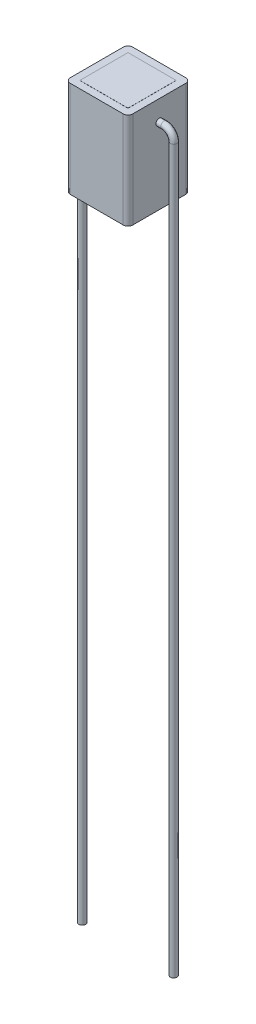
ISO-10303-21;
HEADER;
FILE_DESCRIPTION(('STEP AP214'),'2;1');
FILE_NAME('part.step','',(''),(''),'','','');
FILE_SCHEMA(('AUTOMOTIVE_DESIGN { 1 0 10303 214 1 1 1 1 }'));
ENDSEC;
DATA;
#1=APPLICATION_CONTEXT('core data for automotive mechanical design processes');
#2=APPLICATION_PROTOCOL_DEFINITION('international standard','automotive_design',2000,#1);
#3=PRODUCT_CONTEXT('',#1,'mechanical');
#4=PRODUCT('Part','Part','',(#3));
#5=PRODUCT_RELATED_PRODUCT_CATEGORY('part','',(#4));
#6=PRODUCT_DEFINITION_FORMATION('','',#4);
#7=PRODUCT_DEFINITION_CONTEXT('part definition',#1,'design');
#8=PRODUCT_DEFINITION('design','',#6,#7);
#9=PRODUCT_DEFINITION_SHAPE('','',#8);
#10=(LENGTH_UNIT() NAMED_UNIT(*) SI_UNIT(.MILLI.,.METRE.));
#11=(NAMED_UNIT(*) PLANE_ANGLE_UNIT() SI_UNIT($,.RADIAN.));
#12=(NAMED_UNIT(*) SI_UNIT($,.STERADIAN.) SOLID_ANGLE_UNIT());
#13=UNCERTAINTY_MEASURE_WITH_UNIT(LENGTH_MEASURE(1.E-05),#10,'distance_accuracy_value','');
#14=(GEOMETRIC_REPRESENTATION_CONTEXT(3) GLOBAL_UNCERTAINTY_ASSIGNED_CONTEXT((#13)) GLOBAL_UNIT_ASSIGNED_CONTEXT((#10,
#11,#12)) REPRESENTATION_CONTEXT('',''));
#15=CARTESIAN_POINT('',(0.,0.,0.));
#16=DIRECTION('',(0.,0.,1.));
#17=DIRECTION('',(1.,0.,0.));
#18=AXIS2_PLACEMENT_3D('',#15,#16,#17);
#19=CARTESIAN_POINT('',(3.25000000000001,10.,-3.25));
#20=DIRECTION('',(-1.,0.,0.));
#21=DIRECTION('',(0.,0.,1.));
#22=AXIS2_PLACEMENT_3D('',#19,#20,#21);
#23=PLANE('',#22);
#24=CARTESIAN_POINT('',(3.25000000000001,7.88289673289455,0.));
#25=DIRECTION('',(-1.,0.,0.));
#26=DIRECTION('',(0.,0.,1.));
#27=AXIS2_PLACEMENT_3D('',#24,#25,#26);
#28=CIRCLE('',#27,0.35);
#29=CARTESIAN_POINT('',(3.25000000000001,7.88289673289455,0.35));
#30=VERTEX_POINT('',#29);
#31=EDGE_CURVE('E280',#30,#30,#28,.F.);
#32=ORIENTED_EDGE('',*,*,#31,.F.);
#33=EDGE_LOOP('',(#32));
#34=FACE_BOUND('',#33,.T.);
#35=DIRECTION('',(0.,0.,-1.));
#36=VECTOR('',#35,1.);
#37=CARTESIAN_POINT('',(3.25000000000001,10.,-3.25));
#38=LINE('',#37,#36);
#39=CARTESIAN_POINT('',(3.25000000000001,10.,2.75000000000001));
#40=VERTEX_POINT('',#39);
#41=CARTESIAN_POINT('',(3.25000000000001,10.,-2.75));
#42=VERTEX_POINT('',#41);
#43=EDGE_CURVE('E248',#40,#42,#38,.T.);
#44=ORIENTED_EDGE('',*,*,#43,.F.);
#45=DIRECTION('',(0.,-1.,0.));
#46=VECTOR('',#45,1.);
#47=CARTESIAN_POINT('',(3.25000000000001,10.,2.75000000000001));
#48=LINE('',#47,#46);
#49=CARTESIAN_POINT('',(3.25000000000001,0.,2.75000000000001));
#50=VERTEX_POINT('',#49);
#51=EDGE_CURVE('E288',#40,#50,#48,.T.);
#52=ORIENTED_EDGE('',*,*,#51,.T.);
#53=DIRECTION('',(0.,0.,-1.));
#54=VECTOR('',#53,1.);
#55=CARTESIAN_POINT('',(3.25000000000001,0.,-3.25));
#56=LINE('',#55,#54);
#57=CARTESIAN_POINT('',(3.25000000000001,0.,-2.75));
#58=VERTEX_POINT('',#57);
#59=EDGE_CURVE('E247',#50,#58,#56,.T.);
#60=ORIENTED_EDGE('',*,*,#59,.T.);
#61=DIRECTION('',(0.,-1.,0.));
#62=VECTOR('',#61,1.);
#63=CARTESIAN_POINT('',(3.25000000000001,10.,-2.75));
#64=LINE('',#63,#62);
#65=EDGE_CURVE('E286',#58,#42,#64,.F.);
#66=ORIENTED_EDGE('',*,*,#65,.T.);
#67=EDGE_LOOP('',(#44,#52,#60,#66));
#68=FACE_BOUND('',#67,.T.);
#69=ADVANCED_FACE('F58',(#34,#68),#23,.F.);
#70=CARTESIAN_POINT('',(-3.24999999999999,10.,-3.25));
#71=DIRECTION('',(0.,0.,1.));
#72=DIRECTION('',(1.,0.,0.));
#73=AXIS2_PLACEMENT_3D('',#70,#71,#72);
#74=PLANE('',#73);
#75=DIRECTION('',(-1.,0.,0.));
#76=VECTOR('',#75,1.);
#77=CARTESIAN_POINT('',(-3.24999999999999,0.,-3.25));
#78=LINE('',#77,#76);
#79=CARTESIAN_POINT('',(2.75000000000001,0.,-3.25));
#80=VERTEX_POINT('',#79);
#81=CARTESIAN_POINT('',(-2.74999999999999,0.,-3.25));
#82=VERTEX_POINT('',#81);
#83=EDGE_CURVE('E262',#80,#82,#78,.T.);
#84=ORIENTED_EDGE('',*,*,#83,.T.);
#85=DIRECTION('',(0.,-1.,0.));
#86=VECTOR('',#85,1.);
#87=CARTESIAN_POINT('',(-2.74999999999999,10.,-3.25));
#88=LINE('',#87,#86);
#89=CARTESIAN_POINT('',(-2.74999999999999,10.,-3.25));
#90=VERTEX_POINT('',#89);
#91=EDGE_CURVE('E12',#82,#90,#88,.F.);
#92=ORIENTED_EDGE('',*,*,#91,.T.);
#93=DIRECTION('',(-1.,0.,0.));
#94=VECTOR('',#93,1.);
#95=CARTESIAN_POINT('',(-3.24999999999999,10.,-3.25));
#96=LINE('',#95,#94);
#97=CARTESIAN_POINT('',(2.75000000000001,10.,-3.25));
#98=VERTEX_POINT('',#97);
#99=EDGE_CURVE('E251',#98,#90,#96,.T.);
#100=ORIENTED_EDGE('',*,*,#99,.F.);
#101=DIRECTION('',(0.,-1.,0.));
#102=VECTOR('',#101,1.);
#103=CARTESIAN_POINT('',(2.75000000000001,10.,-3.25));
#104=LINE('',#103,#102);
#105=EDGE_CURVE('E66',#98,#80,#104,.T.);
#106=ORIENTED_EDGE('',*,*,#105,.T.);
#107=EDGE_LOOP('',(#84,#92,#100,#106));
#108=FACE_BOUND('',#107,.T.);
#109=ADVANCED_FACE('F319',(#108),#74,.F.);
#110=CARTESIAN_POINT('',(-3.24999999999999,10.,-3.25));
#111=DIRECTION('',(1.,0.,0.));
#112=DIRECTION('',(0.,0.,-1.));
#113=AXIS2_PLACEMENT_3D('',#110,#111,#112);
#114=PLANE('',#113);
#115=CARTESIAN_POINT('',(-3.24999999999999,7.88289673289455,0.));
#116=DIRECTION('',(1.,0.,0.));
#117=DIRECTION('',(0.,0.,-1.));
#118=AXIS2_PLACEMENT_3D('',#115,#116,#117);
#119=CIRCLE('',#118,0.35);
#120=CARTESIAN_POINT('',(-3.24999999999999,7.88289673289455,-0.35));
#121=VERTEX_POINT('',#120);
#122=EDGE_CURVE('E283',#121,#121,#119,.F.);
#123=ORIENTED_EDGE('',*,*,#122,.F.);
#124=EDGE_LOOP('',(#123));
#125=FACE_BOUND('',#124,.T.);
#126=DIRECTION('',(0.,0.,1.));
#127=VECTOR('',#126,1.);
#128=CARTESIAN_POINT('',(-3.24999999999999,0.,-3.25));
#129=LINE('',#128,#127);
#130=CARTESIAN_POINT('',(-3.24999999999999,0.,-2.75));
#131=VERTEX_POINT('',#130);
#132=CARTESIAN_POINT('',(-3.24999999999999,0.,2.75000000000001));
#133=VERTEX_POINT('',#132);
#134=EDGE_CURVE('E265',#131,#133,#129,.T.);
#135=ORIENTED_EDGE('',*,*,#134,.T.);
#136=DIRECTION('',(0.,-1.,0.));
#137=VECTOR('',#136,1.);
#138=CARTESIAN_POINT('',(-3.24999999999999,10.,2.75000000000001));
#139=LINE('',#138,#137);
#140=CARTESIAN_POINT('',(-3.24999999999999,10.,2.75000000000001));
#141=VERTEX_POINT('',#140);
#142=EDGE_CURVE('E73',#133,#141,#139,.F.);
#143=ORIENTED_EDGE('',*,*,#142,.T.);
#144=DIRECTION('',(0.,0.,1.));
#145=VECTOR('',#144,1.);
#146=CARTESIAN_POINT('',(-3.24999999999999,10.,-3.25));
#147=LINE('',#146,#145);
#148=CARTESIAN_POINT('',(-3.24999999999999,10.,-2.75));
#149=VERTEX_POINT('',#148);
#150=EDGE_CURVE('E254',#149,#141,#147,.T.);
#151=ORIENTED_EDGE('',*,*,#150,.F.);
#152=DIRECTION('',(0.,-1.,0.));
#153=VECTOR('',#152,1.);
#154=CARTESIAN_POINT('',(-3.24999999999999,10.,-2.75));
#155=LINE('',#154,#153);
#156=EDGE_CURVE('E311',#149,#131,#155,.T.);
#157=ORIENTED_EDGE('',*,*,#156,.T.);
#158=EDGE_LOOP('',(#135,#143,#151,#157));
#159=FACE_BOUND('',#158,.T.);
#160=ADVANCED_FACE('F330',(#125,#159),#114,.F.);
#161=CARTESIAN_POINT('',(-3.24999999999999,10.,3.25000000000001));
#162=DIRECTION('',(0.,0.,-1.));
#163=DIRECTION('',(-1.,0.,0.));
#164=AXIS2_PLACEMENT_3D('',#161,#162,#163);
#165=PLANE('',#164);
#166=DIRECTION('',(1.,0.,0.));
#167=VECTOR('',#166,1.);
#168=CARTESIAN_POINT('',(-3.24999999999999,0.,3.25000000000001));
#169=LINE('',#168,#167);
#170=CARTESIAN_POINT('',(-2.74999999999999,0.,3.25000000000001));
#171=VERTEX_POINT('',#170);
#172=CARTESIAN_POINT('',(2.75000000000001,0.,3.25000000000001));
#173=VERTEX_POINT('',#172);
#174=EDGE_CURVE('E252',#171,#173,#169,.T.);
#175=ORIENTED_EDGE('',*,*,#174,.T.);
#176=DIRECTION('',(0.,-1.,0.));
#177=VECTOR('',#176,1.);
#178=CARTESIAN_POINT('',(2.75000000000001,10.,3.25000000000001));
#179=LINE('',#178,#177);
#180=CARTESIAN_POINT('',(2.75000000000001,10.,3.25000000000001));
#181=VERTEX_POINT('',#180);
#182=EDGE_CURVE('E302',#173,#181,#179,.F.);
#183=ORIENTED_EDGE('',*,*,#182,.T.);
#184=DIRECTION('',(1.,0.,0.));
#185=VECTOR('',#184,1.);
#186=CARTESIAN_POINT('',(-3.24999999999999,10.,3.25000000000001));
#187=LINE('',#186,#185);
#188=CARTESIAN_POINT('',(-2.74999999999999,10.,3.25000000000001));
#189=VERTEX_POINT('',#188);
#190=EDGE_CURVE('E256',#189,#181,#187,.T.);
#191=ORIENTED_EDGE('',*,*,#190,.F.);
#192=DIRECTION('',(0.,-1.,0.));
#193=VECTOR('',#192,1.);
#194=CARTESIAN_POINT('',(-2.74999999999999,10.,3.25000000000001));
#195=LINE('',#194,#193);
#196=EDGE_CURVE('E299',#189,#171,#195,.T.);
#197=ORIENTED_EDGE('',*,*,#196,.T.);
#198=EDGE_LOOP('',(#175,#183,#191,#197));
#199=FACE_BOUND('',#198,.T.);
#200=ADVANCED_FACE('F339',(#199),#165,.F.);
#201=CARTESIAN_POINT('',(0.,10.,0.));
#202=DIRECTION('',(0.,1.,0.));
#203=DIRECTION('',(0.,0.,1.));
#204=AXIS2_PLACEMENT_3D('',#201,#202,#203);
#205=PLANE('',#204);
#206=DIRECTION('',(0.,0.,-1.));
#207=VECTOR('',#206,1.);
#208=CARTESIAN_POINT('',(2.5,10.,0.));
#209=LINE('',#208,#207);
#210=CARTESIAN_POINT('',(2.5,10.,2.5));
#211=VERTEX_POINT('',#210);
#212=CARTESIAN_POINT('',(2.5,10.,-2.5));
#213=VERTEX_POINT('',#212);
#214=EDGE_CURVE('E244',#211,#213,#209,.T.);
#215=ORIENTED_EDGE('',*,*,#214,.F.);
#216=DIRECTION('',(1.,0.,0.));
#217=VECTOR('',#216,1.);
#218=CARTESIAN_POINT('',(0.,10.,2.5));
#219=LINE('',#218,#217);
#220=CARTESIAN_POINT('',(-2.5,10.,2.5));
#221=VERTEX_POINT('',#220);
#222=EDGE_CURVE('E241',#221,#211,#219,.T.);
#223=ORIENTED_EDGE('',*,*,#222,.F.);
#224=DIRECTION('',(0.,0.,1.));
#225=VECTOR('',#224,1.);
#226=CARTESIAN_POINT('',(-2.5,10.,0.));
#227=LINE('',#226,#225);
#228=CARTESIAN_POINT('',(-2.5,10.,-2.5));
#229=VERTEX_POINT('',#228);
#230=EDGE_CURVE('E238',#229,#221,#227,.T.);
#231=ORIENTED_EDGE('',*,*,#230,.F.);
#232=DIRECTION('',(-1.,0.,0.));
#233=VECTOR('',#232,1.);
#234=CARTESIAN_POINT('',(0.,10.,-2.5));
#235=LINE('',#234,#233);
#236=EDGE_CURVE('E224',#213,#229,#235,.T.);
#237=ORIENTED_EDGE('',*,*,#236,.F.);
#238=EDGE_LOOP('',(#215,#223,#231,#237));
#239=FACE_BOUND('',#238,.T.);
#240=ORIENTED_EDGE('',*,*,#190,.T.);
#241=CARTESIAN_POINT('',(2.75000000000001,10.,2.75000000000001));
#242=DIRECTION('',(0.,1.,0.));
#243=DIRECTION('',(0.,0.,1.));
#244=AXIS2_PLACEMENT_3D('',#241,#242,#243);
#245=CIRCLE('',#244,0.5);
#246=EDGE_CURVE('E309',#181,#40,#245,.T.);
#247=ORIENTED_EDGE('',*,*,#246,.T.);
#248=ORIENTED_EDGE('',*,*,#43,.T.);
#249=CARTESIAN_POINT('',(2.75000000000001,10.,-2.75));
#250=DIRECTION('',(0.,1.,0.));
#251=DIRECTION('',(0.,0.,1.));
#252=AXIS2_PLACEMENT_3D('',#249,#250,#251);
#253=CIRCLE('',#252,0.5);
#254=EDGE_CURVE('E304',#42,#98,#253,.T.);
#255=ORIENTED_EDGE('',*,*,#254,.T.);
#256=ORIENTED_EDGE('',*,*,#99,.T.);
#257=CARTESIAN_POINT('',(-2.74999999999999,10.,-2.75));
#258=DIRECTION('',(0.,1.,0.));
#259=DIRECTION('',(0.,0.,1.));
#260=AXIS2_PLACEMENT_3D('',#257,#258,#259);
#261=CIRCLE('',#260,0.5);
#262=EDGE_CURVE('E80',#90,#149,#261,.T.);
#263=ORIENTED_EDGE('',*,*,#262,.T.);
#264=ORIENTED_EDGE('',*,*,#150,.T.);
#265=CARTESIAN_POINT('',(-2.74999999999999,10.,2.75000000000001));
#266=DIRECTION('',(0.,1.,0.));
#267=DIRECTION('',(0.,0.,1.));
#268=AXIS2_PLACEMENT_3D('',#265,#266,#267);
#269=CIRCLE('',#268,0.5);
#270=EDGE_CURVE('E307',#141,#189,#269,.T.);
#271=ORIENTED_EDGE('',*,*,#270,.T.);
#272=EDGE_LOOP('',(#240,#247,#248,#255,#256,#263,#264,#271));
#273=FACE_BOUND('',#272,.T.);
#274=ADVANCED_FACE('F332',(#239,#273),#205,.T.);
#275=CARTESIAN_POINT('',(0.,0.,0.));
#276=DIRECTION('',(0.,1.,0.));
#277=DIRECTION('',(0.,0.,1.));
#278=AXIS2_PLACEMENT_3D('',#275,#276,#277);
#279=PLANE('',#278);
#280=DIRECTION('',(1.,0.,0.));
#281=VECTOR('',#280,1.);
#282=CARTESIAN_POINT('',(0.,0.,2.5));
#283=LINE('',#282,#281);
#284=CARTESIAN_POINT('',(-2.5,0.,2.5));
#285=VERTEX_POINT('',#284);
#286=CARTESIAN_POINT('',(2.5,0.,2.5));
#287=VERTEX_POINT('',#286);
#288=EDGE_CURVE('E274',#285,#287,#283,.T.);
#289=ORIENTED_EDGE('',*,*,#288,.T.);
#290=DIRECTION('',(0.,0.,-1.));
#291=VECTOR('',#290,1.);
#292=CARTESIAN_POINT('',(2.5,0.,0.));
#293=LINE('',#292,#291);
#294=CARTESIAN_POINT('',(2.5,0.,-2.5));
#295=VERTEX_POINT('',#294);
#296=EDGE_CURVE('E277',#287,#295,#293,.T.);
#297=ORIENTED_EDGE('',*,*,#296,.T.);
#298=DIRECTION('',(-1.,0.,0.));
#299=VECTOR('',#298,1.);
#300=CARTESIAN_POINT('',(0.,0.,-2.5));
#301=LINE('',#300,#299);
#302=CARTESIAN_POINT('',(-2.5,0.,-2.5));
#303=VERTEX_POINT('',#302);
#304=EDGE_CURVE('E259',#295,#303,#301,.T.);
#305=ORIENTED_EDGE('',*,*,#304,.T.);
#306=DIRECTION('',(0.,0.,1.));
#307=VECTOR('',#306,1.);
#308=CARTESIAN_POINT('',(-2.5,0.,0.));
#309=LINE('',#308,#307);
#310=EDGE_CURVE('E271',#303,#285,#309,.T.);
#311=ORIENTED_EDGE('',*,*,#310,.T.);
#312=EDGE_LOOP('',(#289,#297,#305,#311));
#313=FACE_BOUND('',#312,.T.);
#314=ORIENTED_EDGE('',*,*,#59,.F.);
#315=CARTESIAN_POINT('',(2.75000000000001,0.,2.75000000000001));
#316=DIRECTION('',(0.,1.,0.));
#317=DIRECTION('',(0.,0.,1.));
#318=AXIS2_PLACEMENT_3D('',#315,#316,#317);
#319=CIRCLE('',#318,0.5);
#320=EDGE_CURVE('E297',#50,#173,#319,.F.);
#321=ORIENTED_EDGE('',*,*,#320,.T.);
#322=ORIENTED_EDGE('',*,*,#174,.F.);
#323=CARTESIAN_POINT('',(-2.74999999999999,0.,2.75000000000001));
#324=DIRECTION('',(0.,1.,0.));
#325=DIRECTION('',(0.,0.,1.));
#326=AXIS2_PLACEMENT_3D('',#323,#324,#325);
#327=CIRCLE('',#326,0.5);
#328=EDGE_CURVE('E295',#171,#133,#327,.F.);
#329=ORIENTED_EDGE('',*,*,#328,.T.);
#330=ORIENTED_EDGE('',*,*,#134,.F.);
#331=CARTESIAN_POINT('',(-2.74999999999999,0.,-2.75));
#332=DIRECTION('',(0.,1.,0.));
#333=DIRECTION('',(0.,0.,1.));
#334=AXIS2_PLACEMENT_3D('',#331,#332,#333);
#335=CIRCLE('',#334,0.5);
#336=EDGE_CURVE('E293',#131,#82,#335,.F.);
#337=ORIENTED_EDGE('',*,*,#336,.T.);
#338=ORIENTED_EDGE('',*,*,#83,.F.);
#339=CARTESIAN_POINT('',(2.75000000000001,0.,-2.75));
#340=DIRECTION('',(0.,1.,0.));
#341=DIRECTION('',(0.,0.,1.));
#342=AXIS2_PLACEMENT_3D('',#339,#340,#341);
#343=CIRCLE('',#342,0.5);
#344=EDGE_CURVE('E291',#80,#58,#343,.F.);
#345=ORIENTED_EDGE('',*,*,#344,.T.);
#346=EDGE_LOOP('',(#314,#321,#322,#329,#330,#337,#338,#345));
#347=FACE_BOUND('',#346,.T.);
#348=ADVANCED_FACE('F325',(#313,#347),#279,.F.);
#349=CARTESIAN_POINT('',(0.,-0.01,0.));
#350=DIRECTION('',(0.,1.,0.));
#351=DIRECTION('',(0.,0.,1.));
#352=AXIS2_PLACEMENT_3D('',#349,#350,#351);
#353=PLANE('',#352);
#354=DIRECTION('',(0.,0.,-1.));
#355=VECTOR('',#354,1.);
#356=CARTESIAN_POINT('',(2.5,-0.01,-2.5));
#357=LINE('',#356,#355);
#358=CARTESIAN_POINT('',(2.5,-0.01,2.5));
#359=VERTEX_POINT('',#358);
#360=CARTESIAN_POINT('',(2.5,-0.01,-2.5));
#361=VERTEX_POINT('',#360);
#362=EDGE_CURVE('E208',#359,#361,#357,.T.);
#363=ORIENTED_EDGE('',*,*,#362,.F.);
#364=DIRECTION('',(1.,0.,0.));
#365=VECTOR('',#364,1.);
#366=CARTESIAN_POINT('',(-2.5,-0.01,2.5));
#367=LINE('',#366,#365);
#368=CARTESIAN_POINT('',(-2.5,-0.01,2.5));
#369=VERTEX_POINT('',#368);
#370=EDGE_CURVE('E217',#369,#359,#367,.T.);
#371=ORIENTED_EDGE('',*,*,#370,.F.);
#372=DIRECTION('',(0.,0.,1.));
#373=VECTOR('',#372,1.);
#374=CARTESIAN_POINT('',(-2.5,-0.01,-2.5));
#375=LINE('',#374,#373);
#376=CARTESIAN_POINT('',(-2.5,-0.01,-2.5));
#377=VERTEX_POINT('',#376);
#378=EDGE_CURVE('E214',#377,#369,#375,.T.);
#379=ORIENTED_EDGE('',*,*,#378,.F.);
#380=DIRECTION('',(-1.,0.,0.));
#381=VECTOR('',#380,1.);
#382=CARTESIAN_POINT('',(-2.5,-0.01,-2.5));
#383=LINE('',#382,#381);
#384=EDGE_CURVE('E211',#361,#377,#383,.T.);
#385=ORIENTED_EDGE('',*,*,#384,.F.);
#386=EDGE_LOOP('',(#363,#371,#379,#385));
#387=FACE_BOUND('',#386,.T.);
#388=ADVANCED_FACE('F540',(#387),#353,.F.);
#389=CARTESIAN_POINT('',(-2.5,-0.01,-2.5));
#390=DIRECTION('',(0.,0.,-1.));
#391=DIRECTION('',(-1.,0.,0.));
#392=AXIS2_PLACEMENT_3D('',#389,#390,#391);
#393=PLANE('',#392);
#394=ORIENTED_EDGE('',*,*,#304,.F.);
#395=DIRECTION('',(0.,1.,0.));
#396=VECTOR('',#395,1.);
#397=CARTESIAN_POINT('',(2.5,-0.01,-2.5));
#398=LINE('',#397,#396);
#399=EDGE_CURVE('E233',#361,#295,#398,.T.);
#400=ORIENTED_EDGE('',*,*,#399,.F.);
#401=ORIENTED_EDGE('',*,*,#384,.T.);
#402=DIRECTION('',(0.,1.,0.));
#403=VECTOR('',#402,1.);
#404=CARTESIAN_POINT('',(-2.5,-0.01,-2.5));
#405=LINE('',#404,#403);
#406=EDGE_CURVE('E230',#377,#303,#405,.T.);
#407=ORIENTED_EDGE('',*,*,#406,.T.);
#408=EDGE_LOOP('',(#394,#400,#401,#407));
#409=FACE_BOUND('',#408,.T.);
#410=ADVANCED_FACE('F483',(#409),#393,.T.);
#411=CARTESIAN_POINT('',(-2.5,-0.01,-2.5));
#412=DIRECTION('',(-1.,0.,0.));
#413=DIRECTION('',(0.,0.,1.));
#414=AXIS2_PLACEMENT_3D('',#411,#412,#413);
#415=PLANE('',#414);
#416=ORIENTED_EDGE('',*,*,#310,.F.);
#417=ORIENTED_EDGE('',*,*,#406,.F.);
#418=ORIENTED_EDGE('',*,*,#378,.T.);
#419=DIRECTION('',(0.,1.,0.));
#420=VECTOR('',#419,1.);
#421=CARTESIAN_POINT('',(-2.5,-0.01,2.5));
#422=LINE('',#421,#420);
#423=EDGE_CURVE('E226',#369,#285,#422,.T.);
#424=ORIENTED_EDGE('',*,*,#423,.T.);
#425=EDGE_LOOP('',(#416,#417,#418,#424));
#426=FACE_BOUND('',#425,.T.);
#427=ADVANCED_FACE('F493',(#426),#415,.T.);
#428=CARTESIAN_POINT('',(-2.5,-0.01,2.5));
#429=DIRECTION('',(0.,0.,1.));
#430=DIRECTION('',(1.,0.,0.));
#431=AXIS2_PLACEMENT_3D('',#428,#429,#430);
#432=PLANE('',#431);
#433=ORIENTED_EDGE('',*,*,#288,.F.);
#434=ORIENTED_EDGE('',*,*,#423,.F.);
#435=ORIENTED_EDGE('',*,*,#370,.T.);
#436=DIRECTION('',(0.,1.,0.));
#437=VECTOR('',#436,1.);
#438=CARTESIAN_POINT('',(2.5,-0.01,2.5));
#439=LINE('',#438,#437);
#440=EDGE_CURVE('E221',#359,#287,#439,.T.);
#441=ORIENTED_EDGE('',*,*,#440,.T.);
#442=EDGE_LOOP('',(#433,#434,#435,#441));
#443=FACE_BOUND('',#442,.T.);
#444=ADVANCED_FACE('F503',(#443),#432,.T.);
#445=CARTESIAN_POINT('',(2.5,-0.01,-2.5));
#446=DIRECTION('',(1.,0.,0.));
#447=DIRECTION('',(0.,0.,-1.));
#448=AXIS2_PLACEMENT_3D('',#445,#446,#447);
#449=PLANE('',#448);
#450=ORIENTED_EDGE('',*,*,#296,.F.);
#451=ORIENTED_EDGE('',*,*,#440,.F.);
#452=ORIENTED_EDGE('',*,*,#362,.T.);
#453=ORIENTED_EDGE('',*,*,#399,.T.);
#454=EDGE_LOOP('',(#450,#451,#452,#453));
#455=FACE_BOUND('',#454,.T.);
#456=ADVANCED_FACE('F510',(#455),#449,.T.);
#457=CARTESIAN_POINT('',(2.5,10.01,2.5));
#458=VERTEX_POINT('',#457);
#459=EDGE_CURVE('E225',#211,#458,#439,.T.);
#460=ORIENTED_EDGE('',*,*,#459,.F.);
#461=ORIENTED_EDGE('',*,*,#214,.T.);
#462=CARTESIAN_POINT('',(2.5,10.01,-2.5));
#463=VERTEX_POINT('',#462);
#464=EDGE_CURVE('E220',#213,#463,#398,.T.);
#465=ORIENTED_EDGE('',*,*,#464,.T.);
#466=DIRECTION('',(0.,0.,-1.));
#467=VECTOR('',#466,1.);
#468=CARTESIAN_POINT('',(2.5,10.01,-2.5));
#469=LINE('',#468,#467);
#470=EDGE_CURVE('E196',#458,#463,#469,.T.);
#471=ORIENTED_EDGE('',*,*,#470,.F.);
#472=EDGE_LOOP('',(#460,#461,#465,#471));
#473=FACE_BOUND('',#472,.T.);
#474=ADVANCED_FACE('F500',(#473),#449,.T.);
#475=CARTESIAN_POINT('',(-2.5,10.01,2.5));
#476=VERTEX_POINT('',#475);
#477=EDGE_CURVE('E229',#221,#476,#422,.T.);
#478=ORIENTED_EDGE('',*,*,#477,.F.);
#479=ORIENTED_EDGE('',*,*,#222,.T.);
#480=ORIENTED_EDGE('',*,*,#459,.T.);
#481=DIRECTION('',(1.,0.,0.));
#482=VECTOR('',#481,1.);
#483=CARTESIAN_POINT('',(-2.5,10.01,2.5));
#484=LINE('',#483,#482);
#485=EDGE_CURVE('E205',#476,#458,#484,.T.);
#486=ORIENTED_EDGE('',*,*,#485,.F.);
#487=EDGE_LOOP('',(#478,#479,#480,#486));
#488=FACE_BOUND('',#487,.T.);
#489=ADVANCED_FACE('F490',(#488),#432,.T.);
#490=CARTESIAN_POINT('',(-2.5,10.01,-2.5));
#491=VERTEX_POINT('',#490);
#492=EDGE_CURVE('E232',#229,#491,#405,.T.);
#493=ORIENTED_EDGE('',*,*,#492,.F.);
#494=ORIENTED_EDGE('',*,*,#230,.T.);
#495=ORIENTED_EDGE('',*,*,#477,.T.);
#496=DIRECTION('',(0.,0.,1.));
#497=VECTOR('',#496,1.);
#498=CARTESIAN_POINT('',(-2.5,10.01,-2.5));
#499=LINE('',#498,#497);
#500=EDGE_CURVE('E202',#491,#476,#499,.T.);
#501=ORIENTED_EDGE('',*,*,#500,.F.);
#502=EDGE_LOOP('',(#493,#494,#495,#501));
#503=FACE_BOUND('',#502,.T.);
#504=ADVANCED_FACE('F480',(#503),#415,.T.);
#505=ORIENTED_EDGE('',*,*,#464,.F.);
#506=ORIENTED_EDGE('',*,*,#236,.T.);
#507=ORIENTED_EDGE('',*,*,#492,.T.);
#508=DIRECTION('',(-1.,0.,0.));
#509=VECTOR('',#508,1.);
#510=CARTESIAN_POINT('',(-2.5,10.01,-2.5));
#511=LINE('',#510,#509);
#512=EDGE_CURVE('E199',#463,#491,#511,.T.);
#513=ORIENTED_EDGE('',*,*,#512,.F.);
#514=EDGE_LOOP('',(#505,#506,#507,#513));
#515=FACE_BOUND('',#514,.T.);
#516=ADVANCED_FACE('F470',(#515),#393,.T.);
#517=CARTESIAN_POINT('',(0.,10.01,0.));
#518=DIRECTION('',(0.,1.,0.));
#519=DIRECTION('',(0.,0.,1.));
#520=AXIS2_PLACEMENT_3D('',#517,#518,#519);
#521=PLANE('',#520);
#522=ORIENTED_EDGE('',*,*,#470,.T.);
#523=ORIENTED_EDGE('',*,*,#512,.T.);
#524=ORIENTED_EDGE('',*,*,#500,.T.);
#525=ORIENTED_EDGE('',*,*,#485,.T.);
#526=EDGE_LOOP('',(#522,#523,#524,#525));
#527=FACE_BOUND('',#526,.T.);
#528=ADVANCED_FACE('F435',(#527),#521,.T.);
#529=CARTESIAN_POINT('',(4.75000000000002,-68.1171032671054,0.));
#530=DIRECTION('',(0.,1.,0.));
#531=DIRECTION('',(-1.,0.,0.));
#532=AXIS2_PLACEMENT_3D('',#529,#530,#531);
#533=PLANE('',#532);
#534=CARTESIAN_POINT('',(4.75000000000002,-68.1171032671054,0.));
#535=DIRECTION('',(0.,1.,0.));
#536=DIRECTION('',(-1.,0.,0.));
#537=AXIS2_PLACEMENT_3D('',#534,#535,#536);
#538=CIRCLE('',#537,0.35);
#539=CARTESIAN_POINT('',(4.40000000000002,-68.1171032671054,0.));
#540=VERTEX_POINT('',#539);
#541=EDGE_CURVE('E194',#540,#540,#538,.T.);
#542=ORIENTED_EDGE('',*,*,#541,.F.);
#543=EDGE_LOOP('',(#542));
#544=FACE_BOUND('',#543,.T.);
#545=ADVANCED_FACE('F397',(#544),#533,.F.);
#546=CARTESIAN_POINT('',(3.25000000000002,7.88289673289455,0.));
#547=DIRECTION('',(1.,0.,0.));
#548=DIRECTION('',(0.,0.,-1.));
#549=AXIS2_PLACEMENT_3D('',#546,#547,#548);
#550=CYLINDRICAL_SURFACE('',#549,0.35);
#551=CARTESIAN_POINT('',(3.75,7.88289673289455,0.));
#552=DIRECTION('',(-1.,0.,0.));
#553=DIRECTION('',(0.,-1.,0.));
#554=AXIS2_PLACEMENT_3D('',#551,#552,#553);
#555=CIRCLE('',#554,0.35);
#556=CARTESIAN_POINT('',(3.75,8.23289673289455,0.));
#557=VERTEX_POINT('',#556);
#558=EDGE_CURVE('E181',#557,#557,#555,.T.);
#559=ORIENTED_EDGE('',*,*,#558,.T.);
#560=EDGE_LOOP('',(#559));
#561=FACE_BOUND('',#560,.T.);
#562=ORIENTED_EDGE('',*,*,#31,.T.);
#563=EDGE_LOOP('',(#562));
#564=FACE_BOUND('',#563,.T.);
#565=ADVANCED_FACE('F443',(#561,#564),#550,.T.);
#566=CARTESIAN_POINT('',(3.75000000000001,6.88289673289455,0.));
#567=DIRECTION('',(0.,0.,-1.));
#568=DIRECTION('',(-1.,0.,0.));
#569=AXIS2_PLACEMENT_3D('',#566,#567,#568);
#570=TOROIDAL_SURFACE('',#569,1.,0.35);
#571=CARTESIAN_POINT('',(4.75000000000002,6.88289673289455,0.));
#572=DIRECTION('',(0.,1.,0.));
#573=DIRECTION('',(-1.,0.,0.));
#574=AXIS2_PLACEMENT_3D('',#571,#572,#573);
#575=CIRCLE('',#574,0.35);
#576=CARTESIAN_POINT('',(5.10000000000001,6.88289673289455,0.));
#577=VERTEX_POINT('',#576);
#578=EDGE_CURVE('E185',#577,#577,#575,.T.);
#579=CARTESIAN_POINT('',(3.75000000000001,6.88289673289455,0.));
#580=DIRECTION('',(0.,0.,-1.));
#581=DIRECTION('',(-1.,0.,0.));
#582=AXIS2_PLACEMENT_3D('',#579,#580,#581);
#583=CIRCLE('',#582,1.35);
#584=EDGE_CURVE('',#557,#577,#583,.T.);
#585=ORIENTED_EDGE('',*,*,#558,.F.);
#586=ORIENTED_EDGE('',*,*,#578,.T.);
#587=ORIENTED_EDGE('',*,*,#584,.T.);
#588=ORIENTED_EDGE('',*,*,#584,.F.);
#589=EDGE_LOOP('',(#585,#587,#586,#588));
#590=FACE_BOUND('',#589,.T.);
#591=ADVANCED_FACE('F432',(#590),#570,.T.);
#592=CARTESIAN_POINT('',(4.75000000000001,6.88289673289455,0.));
#593=DIRECTION('',(0.,-1.,0.));
#594=DIRECTION('',(1.,0.,0.));
#595=AXIS2_PLACEMENT_3D('',#592,#593,#594);
#596=CYLINDRICAL_SURFACE('',#595,0.35);
#597=ORIENTED_EDGE('',*,*,#541,.T.);
#598=EDGE_LOOP('',(#597));
#599=FACE_BOUND('',#598,.T.);
#600=ORIENTED_EDGE('',*,*,#578,.F.);
#601=EDGE_LOOP('',(#600));
#602=FACE_BOUND('',#601,.T.);
#603=ADVANCED_FACE('F424',(#599,#602),#596,.T.);
#604=CARTESIAN_POINT('',(-4.75000000000002,-68.1171032671054,0.));
#605=DIRECTION('',(0.,1.,0.));
#606=DIRECTION('',(1.,0.,0.));
#607=AXIS2_PLACEMENT_3D('',#604,#605,#606);
#608=PLANE('',#607);
#609=CARTESIAN_POINT('',(-4.75000000000002,-68.1171032671054,0.));
#610=DIRECTION('',(0.,-1.,0.));
#611=DIRECTION('',(1.,0.,0.));
#612=AXIS2_PLACEMENT_3D('',#609,#610,#611);
#613=CIRCLE('',#612,0.35);
#614=CARTESIAN_POINT('',(-4.40000000000002,-68.1171032671054,0.));
#615=VERTEX_POINT('',#614);
#616=EDGE_CURVE('E177',#615,#615,#613,.F.);
#617=ORIENTED_EDGE('',*,*,#616,.F.);
#618=EDGE_LOOP('',(#617));
#619=FACE_BOUND('',#618,.T.);
#620=ADVANCED_FACE('F364',(#619),#608,.F.);
#621=CARTESIAN_POINT('',(-3.25000000000002,7.88289673289455,0.));
#622=DIRECTION('',(-1.,0.,0.));
#623=DIRECTION('',(0.,0.,1.));
#624=AXIS2_PLACEMENT_3D('',#621,#622,#623);
#625=CYLINDRICAL_SURFACE('',#624,0.35);
#626=CARTESIAN_POINT('',(-3.75,7.88289673289455,0.));
#627=DIRECTION('',(-1.,0.,0.));
#628=DIRECTION('',(0.,-1.,0.));
#629=AXIS2_PLACEMENT_3D('',#626,#627,#628);
#630=CIRCLE('',#629,0.35);
#631=CARTESIAN_POINT('',(-3.75,8.23289673289455,0.));
#632=VERTEX_POINT('',#631);
#633=EDGE_CURVE('E188',#632,#632,#630,.F.);
#634=ORIENTED_EDGE('',*,*,#633,.T.);
#635=EDGE_LOOP('',(#634));
#636=FACE_BOUND('',#635,.T.);
#637=ORIENTED_EDGE('',*,*,#122,.T.);
#638=EDGE_LOOP('',(#637));
#639=FACE_BOUND('',#638,.T.);
#640=ADVANCED_FACE('F405',(#636,#639),#625,.T.);
#641=CARTESIAN_POINT('',(-3.75000000000001,6.88289673289455,0.));
#642=DIRECTION('',(0.,0.,1.));
#643=DIRECTION('',(1.,0.,0.));
#644=AXIS2_PLACEMENT_3D('',#641,#642,#643);
#645=TOROIDAL_SURFACE('',#644,1.,0.35);
#646=CARTESIAN_POINT('',(-4.75000000000002,6.88289673289455,0.));
#647=DIRECTION('',(0.,-1.,0.));
#648=DIRECTION('',(1.,0.,0.));
#649=AXIS2_PLACEMENT_3D('',#646,#647,#648);
#650=CIRCLE('',#649,0.35);
#651=CARTESIAN_POINT('',(-5.10000000000001,6.88289673289455,0.));
#652=VERTEX_POINT('',#651);
#653=EDGE_CURVE('E182',#652,#652,#650,.F.);
#654=CARTESIAN_POINT('',(-3.75000000000001,6.88289673289455,0.));
#655=DIRECTION('',(0.,0.,1.));
#656=DIRECTION('',(1.,0.,0.));
#657=AXIS2_PLACEMENT_3D('',#654,#655,#656);
#658=CIRCLE('',#657,1.35);
#659=EDGE_CURVE('',#632,#652,#658,.T.);
#660=ORIENTED_EDGE('',*,*,#633,.F.);
#661=ORIENTED_EDGE('',*,*,#653,.T.);
#662=ORIENTED_EDGE('',*,*,#659,.T.);
#663=ORIENTED_EDGE('',*,*,#659,.F.);
#664=EDGE_LOOP('',(#660,#662,#661,#663));
#665=FACE_BOUND('',#664,.T.);
#666=ADVANCED_FACE('F395',(#665),#645,.T.);
#667=CARTESIAN_POINT('',(-4.75000000000001,6.88289673289455,0.));
#668=DIRECTION('',(0.,-1.,0.));
#669=DIRECTION('',(1.,0.,0.));
#670=AXIS2_PLACEMENT_3D('',#667,#668,#669);
#671=CYLINDRICAL_SURFACE('',#670,0.35);
#672=ORIENTED_EDGE('',*,*,#616,.T.);
#673=EDGE_LOOP('',(#672));
#674=FACE_BOUND('',#673,.T.);
#675=ORIENTED_EDGE('',*,*,#653,.F.);
#676=EDGE_LOOP('',(#675));
#677=FACE_BOUND('',#676,.T.);
#678=ADVANCED_FACE('F178',(#674,#677),#671,.T.);
#679=CARTESIAN_POINT('',(2.75000000000001,10.,2.75000000000001));
#680=DIRECTION('',(0.,-1.,0.));
#681=DIRECTION('',(0.,0.,-1.));
#682=AXIS2_PLACEMENT_3D('',#679,#680,#681);
#683=CYLINDRICAL_SURFACE('',#682,0.5);
#684=ORIENTED_EDGE('',*,*,#246,.F.);
#685=ORIENTED_EDGE('',*,*,#182,.F.);
#686=ORIENTED_EDGE('',*,*,#320,.F.);
#687=ORIENTED_EDGE('',*,*,#51,.F.);
#688=EDGE_LOOP('',(#684,#685,#686,#687));
#689=FACE_BOUND('',#688,.T.);
#690=ADVANCED_FACE('F344',(#689),#683,.T.);
#691=CARTESIAN_POINT('',(-2.74999999999999,10.,2.75000000000001));
#692=DIRECTION('',(0.,-1.,0.));
#693=DIRECTION('',(0.,0.,-1.));
#694=AXIS2_PLACEMENT_3D('',#691,#692,#693);
#695=CYLINDRICAL_SURFACE('',#694,0.5);
#696=ORIENTED_EDGE('',*,*,#270,.F.);
#697=ORIENTED_EDGE('',*,*,#142,.F.);
#698=ORIENTED_EDGE('',*,*,#328,.F.);
#699=ORIENTED_EDGE('',*,*,#196,.F.);
#700=EDGE_LOOP('',(#696,#697,#698,#699));
#701=FACE_BOUND('',#700,.T.);
#702=ADVANCED_FACE('F336',(#701),#695,.T.);
#703=CARTESIAN_POINT('',(-2.74999999999999,10.,-2.75));
#704=DIRECTION('',(0.,-1.,0.));
#705=DIRECTION('',(0.,0.,-1.));
#706=AXIS2_PLACEMENT_3D('',#703,#704,#705);
#707=CYLINDRICAL_SURFACE('',#706,0.5);
#708=ORIENTED_EDGE('',*,*,#262,.F.);
#709=ORIENTED_EDGE('',*,*,#91,.F.);
#710=ORIENTED_EDGE('',*,*,#336,.F.);
#711=ORIENTED_EDGE('',*,*,#156,.F.);
#712=EDGE_LOOP('',(#708,#709,#710,#711));
#713=FACE_BOUND('',#712,.T.);
#714=ADVANCED_FACE('F329',(#713),#707,.T.);
#715=CARTESIAN_POINT('',(2.75000000000001,10.,-2.75));
#716=DIRECTION('',(0.,-1.,0.));
#717=DIRECTION('',(0.,0.,-1.));
#718=AXIS2_PLACEMENT_3D('',#715,#716,#717);
#719=CYLINDRICAL_SURFACE('',#718,0.5);
#720=ORIENTED_EDGE('',*,*,#254,.F.);
#721=ORIENTED_EDGE('',*,*,#65,.F.);
#722=ORIENTED_EDGE('',*,*,#344,.F.);
#723=ORIENTED_EDGE('',*,*,#105,.F.);
#724=EDGE_LOOP('',(#720,#721,#722,#723));
#725=FACE_BOUND('',#724,.T.);
#726=ADVANCED_FACE('F60',(#725),#719,.T.);
#727=CLOSED_SHELL('',(#69,#109,#160,#200,#274,#348,#388,#410,#427,#444,#456,#474,#489,#504,#516,
#528,#545,#565,#591,#603,#620,#640,#666,#678,#690,#702,#714,#726));
#728=MANIFOLD_SOLID_BREP('B2',#727);
#729=ADVANCED_BREP_SHAPE_REPRESENTATION('',(#18,#728),#14);
#730=SHAPE_DEFINITION_REPRESENTATION(#9,#729);
ENDSEC;
END-ISO-10303-21;
